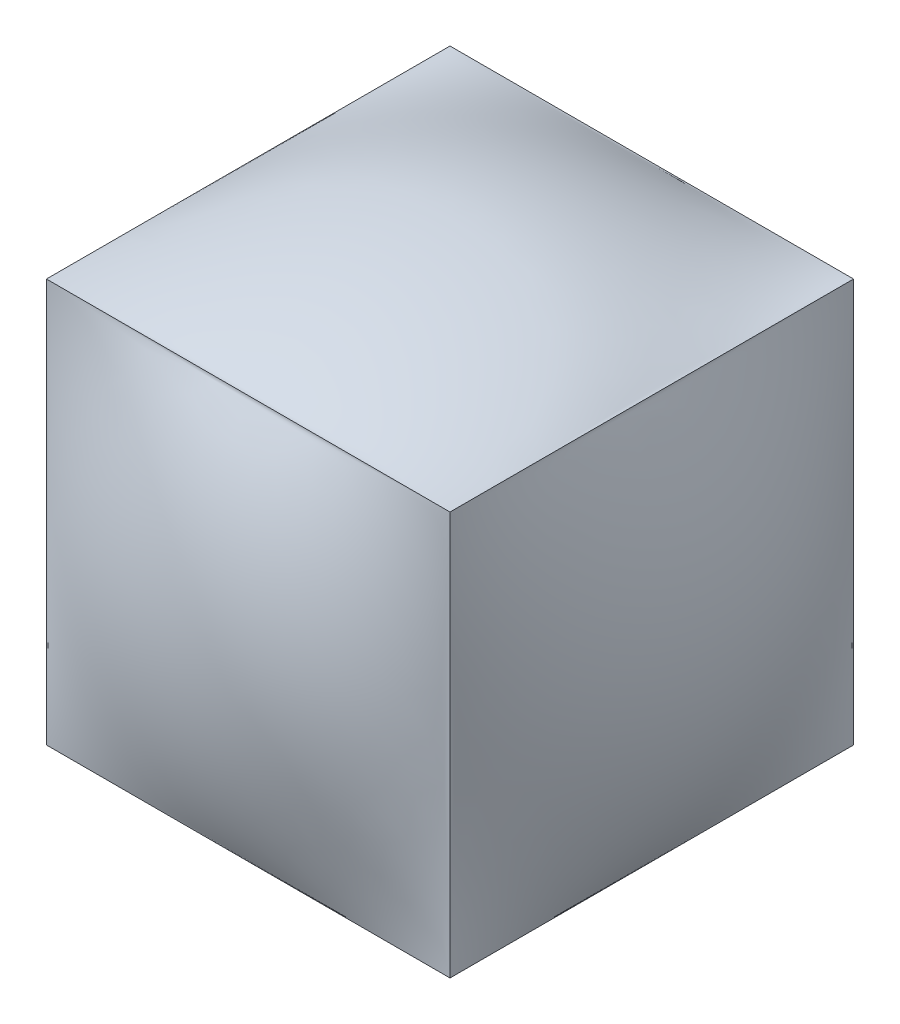
ISO-10303-21;
HEADER;
FILE_DESCRIPTION(('STEP AP214'),'2;1');
FILE_NAME('part.step','',(''),(''),'','','');
FILE_SCHEMA(('AUTOMOTIVE_DESIGN { 1 0 10303 214 1 1 1 1 }'));
ENDSEC;
DATA;
#1=APPLICATION_CONTEXT('core data for automotive mechanical design processes');
#2=APPLICATION_PROTOCOL_DEFINITION('international standard','automotive_design',2000,#1);
#3=PRODUCT_CONTEXT('',#1,'mechanical');
#4=PRODUCT('Part','Part','',(#3));
#5=PRODUCT_RELATED_PRODUCT_CATEGORY('part','',(#4));
#6=PRODUCT_DEFINITION_FORMATION('','',#4);
#7=PRODUCT_DEFINITION_CONTEXT('part definition',#1,'design');
#8=PRODUCT_DEFINITION('design','',#6,#7);
#9=PRODUCT_DEFINITION_SHAPE('','',#8);
#10=(LENGTH_UNIT() NAMED_UNIT(*) SI_UNIT(.MILLI.,.METRE.));
#11=(NAMED_UNIT(*) PLANE_ANGLE_UNIT() SI_UNIT($,.RADIAN.));
#12=(NAMED_UNIT(*) SI_UNIT($,.STERADIAN.) SOLID_ANGLE_UNIT());
#13=UNCERTAINTY_MEASURE_WITH_UNIT(LENGTH_MEASURE(1.E-05),#10,'distance_accuracy_value','');
#14=(GEOMETRIC_REPRESENTATION_CONTEXT(3) GLOBAL_UNCERTAINTY_ASSIGNED_CONTEXT((#13)) GLOBAL_UNIT_ASSIGNED_CONTEXT((#10,
#11,#12)) REPRESENTATION_CONTEXT('',''));
#15=CARTESIAN_POINT('',(0.,0.,0.));
#16=DIRECTION('',(0.,0.,1.));
#17=DIRECTION('',(1.,0.,0.));
#18=AXIS2_PLACEMENT_3D('',#15,#16,#17);
#19=CARTESIAN_POINT('',(-12.7,-12.7000000000001,12.6999999999999));
#20=CARTESIAN_POINT('',(-12.7,-12.7000000000001,8.46666666666658));
#21=CARTESIAN_POINT('',(-12.7,-12.7,0.));
#22=CARTESIAN_POINT('',(-12.7,-12.6999999999999,-8.46666666666676));
#23=CARTESIAN_POINT('',(-12.7,-12.6999999999999,-12.7000000000001));
#24=CARTESIAN_POINT('',(-11.6416666666667,-12.7000000000001,12.6999999999999));
#25=CARTESIAN_POINT('',(-11.6892399385699,-12.9708323422019,8.46666666666658));
#26=CARTESIAN_POINT('',(-11.8010748659707,-13.5437568192709,0.));
#27=CARTESIAN_POINT('',(-11.6892399385699,-12.9708323422018,-8.46666666666676));
#28=CARTESIAN_POINT('',(-11.6416666666667,-12.6999999999999,-12.7000000000001));
#29=CARTESIAN_POINT('',(-9.525,-12.7000000000001,12.6999999999999));
#30=CARTESIAN_POINT('',(-9.63309858409633,-13.5266884324954,8.50473083350684));
#31=CARTESIAN_POINT('',(-9.88267251947771,-14.9590467223422,-1.05178745472811E-13));
#32=CARTESIAN_POINT('',(-9.63309858409632,-13.5266884324953,-8.50473083350703));
#33=CARTESIAN_POINT('',(-9.525,-12.6999999999999,-12.7000000000001));
#34=CARTESIAN_POINT('',(-6.35000000000001,-12.7000000000001,12.6999999999999));
#35=CARTESIAN_POINT('',(-6.46865259362071,-14.27709550517,8.6189233340276));
#36=CARTESIAN_POINT('',(-6.73307640420296,-16.347931036693,-1.12577220955019E-13));
#37=CARTESIAN_POINT('',(-6.46865259362071,-14.2770955051698,-8.6189233340278));
#38=CARTESIAN_POINT('',(-6.35000000000001,-12.6999999999999,-12.7000000000001));
#39=CARTESIAN_POINT('',(-3.175,-12.7000000000001,12.6999999999999));
#40=CARTESIAN_POINT('',(-3.2490780150671,-14.8217020298357,8.73311583454839));
#41=CARTESIAN_POINT('',(-3.40557823699848,-17.0959688625182,-1.15500686733801E-13));
#42=CARTESIAN_POINT('',(-3.2490780150671,-14.8217020298356,-8.73311583454859));
#43=CARTESIAN_POINT('',(-3.175,-12.6999999999999,-12.7000000000001));
#44=CARTESIAN_POINT('',(-1.05833333333333,-12.7000000000001,12.6999999999999));
#45=CARTESIAN_POINT('',(-1.08330869872354,-14.9683052837959,8.77118000138864));
#46=CARTESIAN_POINT('',(-1.13325942950395,-17.2366105675916,-1.16459550176389E-13));
#47=CARTESIAN_POINT('',(-1.08330869872354,-14.9683052837957,-8.77118000138884));
#48=CARTESIAN_POINT('',(-1.05833333333333,-12.6999999999999,-12.7000000000001));
#49=CARTESIAN_POINT('',(1.05833333333333,-12.7000000000001,12.6999999999999));
#50=CARTESIAN_POINT('',(1.08330869872354,-14.9683052837959,8.77118000138864));
#51=CARTESIAN_POINT('',(1.13325942950395,-17.2366105675916,-1.16459550176389E-13));
#52=CARTESIAN_POINT('',(1.08330869872354,-14.9683052837957,-8.77118000138884));
#53=CARTESIAN_POINT('',(1.05833333333333,-12.6999999999999,-12.7000000000001));
#54=CARTESIAN_POINT('',(3.17500000000001,-12.7000000000001,12.6999999999999));
#55=CARTESIAN_POINT('',(3.2490780150671,-14.8217020298357,8.7331158345484));
#56=CARTESIAN_POINT('',(3.40557823699846,-17.0959688625182,-1.15965344807723E-13));
#57=CARTESIAN_POINT('',(3.2490780150671,-14.8217020298356,-8.73311583454861));
#58=CARTESIAN_POINT('',(3.17500000000001,-12.6999999999999,-12.7000000000001));
#59=CARTESIAN_POINT('',(6.34999999999999,-12.7000000000001,12.6999999999999));
#60=CARTESIAN_POINT('',(6.46865259362071,-14.27709550517,8.61892333402759));
#61=CARTESIAN_POINT('',(6.73307640420301,-16.3479310366931,-1.14435853250708E-13));
#62=CARTESIAN_POINT('',(6.46865259362071,-14.2770955051699,-8.61892333402779));
#63=CARTESIAN_POINT('',(6.34999999999999,-12.6999999999999,-12.7000000000001));
#64=CARTESIAN_POINT('',(9.52500000000001,-12.7000000000001,12.6999999999999));
#65=CARTESIAN_POINT('',(9.63309858409632,-13.5266884324953,8.50473083350685));
#66=CARTESIAN_POINT('',(9.8826725194777,-14.9590467223422,-1.09174804908543E-13));
#67=CARTESIAN_POINT('',(9.63309858409633,-13.5266884324952,-8.50473083350704));
#68=CARTESIAN_POINT('',(9.52500000000001,-12.6999999999999,-12.7000000000001));
#69=CARTESIAN_POINT('',(11.6416666666667,-12.7000000000001,12.6999999999999));
#70=CARTESIAN_POINT('',(11.6892399385699,-12.9708323422019,8.46666666666657));
#71=CARTESIAN_POINT('',(11.8010748659707,-13.5437568192709,-1.00523226508998E-13));
#72=CARTESIAN_POINT('',(11.6892399385699,-12.9708323422018,-8.46666666666676));
#73=CARTESIAN_POINT('',(11.6416666666667,-12.6999999999999,-12.7000000000001));
#74=CARTESIAN_POINT('',(12.7,-12.7000000000001,12.6999999999999));
#75=CARTESIAN_POINT('',(12.7,-12.7000000000001,8.46666666666657));
#76=CARTESIAN_POINT('',(12.7,-12.7,0.));
#77=CARTESIAN_POINT('',(12.7,-12.6999999999999,-8.46666666666676));
#78=CARTESIAN_POINT('',(12.7,-12.6999999999999,-12.7000000000001));
#79=B_SPLINE_SURFACE_WITH_KNOTS('',3,3,((#19,#20,#21,#22,#23),(#24,#25,#26,#27,#28),(#29,#30,
#31,#32,#33),(#34,#35,#36,#37,#38),(#39,#40,#41,#42,#43),(#44,#45,#46,#47,#48),(#49,#50,#51,#52,
#53),(#54,#55,#56,#57,#58),(#59,#60,#61,#62,#63),(#64,#65,#66,#67,#68),(#69,#70,#71,#72,#73),
(#74,#75,#76,#77,#78)),.UNSPECIFIED.,.F.,.F.,.F.,(4,1,1,1,2,1,1,1,4),(4,1,4),(0.,0.125,0.25,
0.375,0.5,0.625,0.75,0.875,1.),(0.,0.5,1.),.UNSPECIFIED.);
#80=DIRECTION('',(-1.,0.,0.));
#81=VECTOR('',#80,1.);
#82=CARTESIAN_POINT('',(0.,-12.7,12.7));
#83=LINE('',#82,#81);
#84=CARTESIAN_POINT('',(12.7,-12.7000000000001,12.7));
#85=VERTEX_POINT('',#84);
#86=CARTESIAN_POINT('',(-12.7,-12.7000000000001,12.6999999999999));
#87=VERTEX_POINT('',#86);
#88=EDGE_CURVE('E101',#85,#87,#83,.T.);
#89=DIRECTION('',(0.,0.,-1.));
#90=VECTOR('',#89,1.);
#91=CARTESIAN_POINT('',(-12.7,-12.7,0.));
#92=LINE('',#91,#90);
#93=CARTESIAN_POINT('',(-12.7,-12.7,-12.7000000000001));
#94=VERTEX_POINT('',#93);
#95=EDGE_CURVE('E65',#87,#94,#92,.T.);
#96=DIRECTION('',(1.,0.,0.));
#97=VECTOR('',#96,1.);
#98=CARTESIAN_POINT('',(0.,-12.6999999999999,-12.7000000000001));
#99=LINE('',#98,#97);
#100=CARTESIAN_POINT('',(12.7,-12.7,-12.7));
#101=VERTEX_POINT('',#100);
#102=EDGE_CURVE('E136',#94,#101,#99,.T.);
#103=DIRECTION('',(0.,0.,1.));
#104=VECTOR('',#103,1.);
#105=CARTESIAN_POINT('',(12.7,-12.7,1.33025516058267E-13));
#106=LINE('',#105,#104);
#107=EDGE_CURVE('E118',#101,#85,#106,.T.);
#108=ORIENTED_EDGE('',*,*,#88,.T.);
#109=ORIENTED_EDGE('',*,*,#95,.T.);
#110=ORIENTED_EDGE('',*,*,#102,.T.);
#111=ORIENTED_EDGE('',*,*,#107,.T.);
#112=EDGE_LOOP('',(#108,#109,#110,#111));
#113=FACE_BOUND('',#112,.T.);
#114=ADVANCED_FACE('F60',(#113),#79,.F.);
#115=CARTESIAN_POINT('',(-12.7,12.7,-12.7));
#116=CARTESIAN_POINT('',(-12.7,8.46666666666662,-12.7));
#117=CARTESIAN_POINT('',(-12.7,0.,-12.7));
#118=CARTESIAN_POINT('',(-12.6999999999999,-8.46666666666671,-12.7));
#119=CARTESIAN_POINT('',(-12.6999999999999,-12.7,-12.7));
#120=CARTESIAN_POINT('',(-12.7,12.7,-11.6416666666667));
#121=CARTESIAN_POINT('',(-12.9708323422018,8.46666666666662,-11.6892399385699));
#122=CARTESIAN_POINT('',(-13.5437568192708,0.,-11.8010748659707));
#123=CARTESIAN_POINT('',(-12.9708323422018,-8.46666666666671,-11.6892399385699));
#124=CARTESIAN_POINT('',(-12.6999999999999,-12.7,-11.6416666666667));
#125=CARTESIAN_POINT('',(-12.7,12.7,-9.52500000000004));
#126=CARTESIAN_POINT('',(-13.5266884324953,8.50473083350688,-9.63309858409637));
#127=CARTESIAN_POINT('',(-14.9590467223421,0.,-9.88267251947776));
#128=CARTESIAN_POINT('',(-13.5266884324952,-8.50473083350698,-9.63309858409637));
#129=CARTESIAN_POINT('',(-12.6999999999999,-12.7000000000001,-9.52500000000004));
#130=CARTESIAN_POINT('',(-12.7,12.6999999999999,-6.35000000000005));
#131=CARTESIAN_POINT('',(-14.2770955051699,8.61892333402765,-6.46865259362076));
#132=CARTESIAN_POINT('',(-16.347931036693,0.,-6.73307640420302));
#133=CARTESIAN_POINT('',(-14.2770955051698,-8.61892333402775,-6.46865259362076));
#134=CARTESIAN_POINT('',(-12.6999999999999,-12.7,-6.35000000000005));
#135=CARTESIAN_POINT('',(-12.7,12.7,-3.17500000000004));
#136=CARTESIAN_POINT('',(-14.8217020298356,8.73311583454844,-3.24907801506715));
#137=CARTESIAN_POINT('',(-17.0959688625182,0.,-3.40557823699854));
#138=CARTESIAN_POINT('',(-14.8217020298356,-8.73311583454854,-3.24907801506715));
#139=CARTESIAN_POINT('',(-12.6999999999999,-12.7,-3.17500000000004));
#140=CARTESIAN_POINT('',(-12.7,12.7,-1.05833333333338));
#141=CARTESIAN_POINT('',(-14.9683052837958,8.77118000138869,-1.08330869872359));
#142=CARTESIAN_POINT('',(-17.2366105675916,0.,-1.13325942950401));
#143=CARTESIAN_POINT('',(-14.9683052837958,-8.77118000138879,-1.08330869872359));
#144=CARTESIAN_POINT('',(-12.7,-12.7,-1.05833333333338));
#145=CARTESIAN_POINT('',(-12.7000000000001,12.7,1.05833333333329));
#146=CARTESIAN_POINT('',(-14.9683052837958,8.77118000138869,1.08330869872349));
#147=CARTESIAN_POINT('',(-17.2366105675916,0.,1.13325942950389));
#148=CARTESIAN_POINT('',(-14.9683052837958,-8.77118000138879,1.08330869872349));
#149=CARTESIAN_POINT('',(-12.7,-12.7,1.05833333333329));
#150=CARTESIAN_POINT('',(-12.7000000000001,12.7,3.17499999999997));
#151=CARTESIAN_POINT('',(-14.8217020298357,8.73311583454845,3.24907801506705));
#152=CARTESIAN_POINT('',(-17.0959688625182,0.,3.4055782369984));
#153=CARTESIAN_POINT('',(-14.8217020298356,-8.73311583454855,3.24907801506705));
#154=CARTESIAN_POINT('',(-12.7,-12.7000000000001,3.17499999999997));
#155=CARTESIAN_POINT('',(-12.7000000000001,12.6999999999999,6.34999999999994));
#156=CARTESIAN_POINT('',(-14.27709550517,8.61892333402764,6.46865259362066));
#157=CARTESIAN_POINT('',(-16.3479310366931,0.,6.73307640420295));
#158=CARTESIAN_POINT('',(-14.2770955051699,-8.61892333402774,6.46865259362066));
#159=CARTESIAN_POINT('',(-12.7,-12.7,6.34999999999994));
#160=CARTESIAN_POINT('',(-12.7000000000001,12.7,9.52499999999997));
#161=CARTESIAN_POINT('',(-13.5266884324953,8.50473083350689,9.63309858409627));
#162=CARTESIAN_POINT('',(-14.9590467223422,0.,9.88267251947764));
#163=CARTESIAN_POINT('',(-13.5266884324953,-8.50473083350699,9.63309858409628));
#164=CARTESIAN_POINT('',(-12.7,-12.7000000000001,9.52499999999997));
#165=CARTESIAN_POINT('',(-12.7000000000001,12.7,11.6416666666666));
#166=CARTESIAN_POINT('',(-12.9708323422019,8.46666666666662,11.6892399385698));
#167=CARTESIAN_POINT('',(-13.5437568192709,0.,11.8010748659707));
#168=CARTESIAN_POINT('',(-12.9708323422019,-8.46666666666671,11.6892399385698));
#169=CARTESIAN_POINT('',(-12.7,-12.7,11.6416666666666));
#170=CARTESIAN_POINT('',(-12.7000000000001,12.7,12.7));
#171=CARTESIAN_POINT('',(-12.7000000000001,8.46666666666662,12.7));
#172=CARTESIAN_POINT('',(-12.7,0.,12.6999999999999));
#173=CARTESIAN_POINT('',(-12.7,-8.46666666666671,12.7));
#174=CARTESIAN_POINT('',(-12.7,-12.7,12.7));
#175=B_SPLINE_SURFACE_WITH_KNOTS('',3,3,((#115,#116,#117,#118,#119),(#120,#121,#122,#123,#124),
(#125,#126,#127,#128,#129),(#130,#131,#132,#133,#134),(#135,#136,#137,#138,#139),(#140,#141,
#142,#143,#144),(#145,#146,#147,#148,#149),(#150,#151,#152,#153,#154),(#155,#156,#157,#158,
#159),(#160,#161,#162,#163,#164),(#165,#166,#167,#168,#169),(#170,#171,#172,#173,#174)),
.UNSPECIFIED.,.F.,.F.,.F.,(4,1,1,1,2,1,1,1,4),(4,1,4),(0.,0.125,0.25,0.375,0.5,0.625,0.75,0.875,
1.),(0.,0.5,1.),.UNSPECIFIED.);
#176=DIRECTION('',(0.,0.,-1.));
#177=VECTOR('',#176,1.);
#178=CARTESIAN_POINT('',(-12.7,12.7,0.));
#179=LINE('',#178,#177);
#180=CARTESIAN_POINT('',(-12.7,12.7,12.7));
#181=VERTEX_POINT('',#180);
#182=CARTESIAN_POINT('',(-12.7,12.7,-12.7));
#183=VERTEX_POINT('',#182);
#184=EDGE_CURVE('E81',#181,#183,#179,.T.);
#185=DIRECTION('',(0.,-1.,0.));
#186=VECTOR('',#185,1.);
#187=CARTESIAN_POINT('',(-12.7,1.3432655866525E-13,-12.7));
#188=LINE('',#187,#186);
#189=EDGE_CURVE('E109',#183,#94,#188,.T.);
#190=DIRECTION('',(0.,1.,0.));
#191=VECTOR('',#190,1.);
#192=CARTESIAN_POINT('',(-12.7,0.,12.7));
#193=LINE('',#192,#191);
#194=EDGE_CURVE('E107',#87,#181,#193,.T.);
#195=ORIENTED_EDGE('',*,*,#184,.T.);
#196=ORIENTED_EDGE('',*,*,#189,.T.);
#197=ORIENTED_EDGE('',*,*,#95,.F.);
#198=ORIENTED_EDGE('',*,*,#194,.T.);
#199=EDGE_LOOP('',(#195,#196,#197,#198));
#200=FACE_BOUND('',#199,.T.);
#201=ADVANCED_FACE('F106',(#200),#175,.F.);
#202=CARTESIAN_POINT('',(-12.7,12.7,12.7));
#203=CARTESIAN_POINT('',(-12.7,8.46666666666662,12.7));
#204=CARTESIAN_POINT('',(-12.7,0.,12.7));
#205=CARTESIAN_POINT('',(-12.7,-8.46666666666671,12.7));
#206=CARTESIAN_POINT('',(-12.7,-12.7,12.7));
#207=CARTESIAN_POINT('',(-11.6416666666667,12.7,12.7));
#208=CARTESIAN_POINT('',(-11.6892399385699,8.46666666666662,12.9708323422019));
#209=CARTESIAN_POINT('',(-11.8010748659707,0.,13.5437568192709));
#210=CARTESIAN_POINT('',(-11.6892399385699,-8.46666666666671,12.9708323422018));
#211=CARTESIAN_POINT('',(-11.6416666666667,-12.7,12.7));
#212=CARTESIAN_POINT('',(-9.525,12.7,12.7000000000001));
#213=CARTESIAN_POINT('',(-9.63309858409633,8.50473083350688,13.5266884324953));
#214=CARTESIAN_POINT('',(-9.88267251947771,0.,14.9590467223422));
#215=CARTESIAN_POINT('',(-9.63309858409632,-8.50473083350698,13.5266884324953));
#216=CARTESIAN_POINT('',(-9.525,-12.7000000000001,12.7));
#217=CARTESIAN_POINT('',(-6.35000000000001,12.6999999999999,12.7));
#218=CARTESIAN_POINT('',(-6.46865259362071,8.61892333402765,14.2770955051699));
#219=CARTESIAN_POINT('',(-6.73307640420296,0.,16.347931036693));
#220=CARTESIAN_POINT('',(-6.46865259362071,-8.61892333402775,14.2770955051699));
#221=CARTESIAN_POINT('',(-6.35000000000001,-12.7,12.7));
#222=CARTESIAN_POINT('',(-3.175,12.7,12.7));
#223=CARTESIAN_POINT('',(-3.2490780150671,8.73311583454844,14.8217020298357));
#224=CARTESIAN_POINT('',(-3.40557823699848,0.,17.0959688625182));
#225=CARTESIAN_POINT('',(-3.2490780150671,-8.73311583454854,14.8217020298356));
#226=CARTESIAN_POINT('',(-3.175,-12.7,12.7));
#227=CARTESIAN_POINT('',(-1.05833333333333,12.7,12.7));
#228=CARTESIAN_POINT('',(-1.08330869872354,8.77118000138869,14.9683052837958));
#229=CARTESIAN_POINT('',(-1.13325942950395,0.,17.2366105675916));
#230=CARTESIAN_POINT('',(-1.08330869872354,-8.77118000138879,14.9683052837958));
#231=CARTESIAN_POINT('',(-1.05833333333333,-12.7,12.7));
#232=CARTESIAN_POINT('',(1.05833333333333,12.7,12.7));
#233=CARTESIAN_POINT('',(1.08330869872354,8.77118000138869,14.9683052837958));
#234=CARTESIAN_POINT('',(1.13325942950395,0.,17.2366105675916));
#235=CARTESIAN_POINT('',(1.08330869872354,-8.77118000138879,14.9683052837958));
#236=CARTESIAN_POINT('',(1.05833333333333,-12.7,12.7));
#237=CARTESIAN_POINT('',(3.17500000000001,12.7,12.7000000000001));
#238=CARTESIAN_POINT('',(3.2490780150671,8.73311583454845,14.8217020298356));
#239=CARTESIAN_POINT('',(3.40557823699846,0.,17.0959688625182));
#240=CARTESIAN_POINT('',(3.2490780150671,-8.73311583454855,14.8217020298356));
#241=CARTESIAN_POINT('',(3.17500000000001,-12.7000000000001,12.7));
#242=CARTESIAN_POINT('',(6.34999999999999,12.6999999999999,12.7000000000001));
#243=CARTESIAN_POINT('',(6.46865259362071,8.61892333402764,14.2770955051699));
#244=CARTESIAN_POINT('',(6.73307640420301,0.,16.3479310366931));
#245=CARTESIAN_POINT('',(6.46865259362071,-8.61892333402774,14.2770955051699));
#246=CARTESIAN_POINT('',(6.34999999999999,-12.7,12.7));
#247=CARTESIAN_POINT('',(9.52500000000001,12.7,12.7));
#248=CARTESIAN_POINT('',(9.63309858409632,8.50473083350689,13.5266884324953));
#249=CARTESIAN_POINT('',(9.8826725194777,0.,14.9590467223422));
#250=CARTESIAN_POINT('',(9.63309858409633,-8.50473083350699,13.5266884324953));
#251=CARTESIAN_POINT('',(9.52500000000001,-12.7000000000001,12.7));
#252=CARTESIAN_POINT('',(11.6416666666667,12.7,12.7));
#253=CARTESIAN_POINT('',(11.6892399385699,8.46666666666662,12.9708323422019));
#254=CARTESIAN_POINT('',(11.8010748659707,0.,13.5437568192709));
#255=CARTESIAN_POINT('',(11.6892399385699,-8.46666666666671,12.9708323422018));
#256=CARTESIAN_POINT('',(11.6416666666667,-12.7,12.7));
#257=CARTESIAN_POINT('',(12.7,12.7,12.7));
#258=CARTESIAN_POINT('',(12.7,8.46666666666662,12.7));
#259=CARTESIAN_POINT('',(12.7,0.,12.7));
#260=CARTESIAN_POINT('',(12.7,-8.46666666666671,12.7));
#261=CARTESIAN_POINT('',(12.7,-12.7,12.7));
#262=B_SPLINE_SURFACE_WITH_KNOTS('',3,3,((#202,#203,#204,#205,#206),(#207,#208,#209,#210,#211),
(#212,#213,#214,#215,#216),(#217,#218,#219,#220,#221),(#222,#223,#224,#225,#226),(#227,#228,
#229,#230,#231),(#232,#233,#234,#235,#236),(#237,#238,#239,#240,#241),(#242,#243,#244,#245,
#246),(#247,#248,#249,#250,#251),(#252,#253,#254,#255,#256),(#257,#258,#259,#260,#261)),
.UNSPECIFIED.,.F.,.F.,.F.,(4,1,1,1,2,1,1,1,4),(4,1,4),(0.,0.125,0.25,0.375,0.5,0.625,0.75,0.875,
1.),(0.,0.5,1.),.UNSPECIFIED.);
#263=DIRECTION('',(-1.,0.,0.));
#264=VECTOR('',#263,1.);
#265=CARTESIAN_POINT('',(0.,12.7,12.7));
#266=LINE('',#265,#264);
#267=CARTESIAN_POINT('',(12.7,12.7,12.7000000000001));
#268=VERTEX_POINT('',#267);
#269=EDGE_CURVE('E115',#268,#181,#266,.T.);
#270=DIRECTION('',(0.,1.,0.));
#271=VECTOR('',#270,1.);
#272=CARTESIAN_POINT('',(12.6999999999999,0.,12.7000000000001));
#273=LINE('',#272,#271);
#274=EDGE_CURVE('E120',#85,#268,#273,.T.);
#275=ORIENTED_EDGE('',*,*,#269,.T.);
#276=ORIENTED_EDGE('',*,*,#194,.F.);
#277=ORIENTED_EDGE('',*,*,#88,.F.);
#278=ORIENTED_EDGE('',*,*,#274,.T.);
#279=EDGE_LOOP('',(#275,#276,#277,#278));
#280=FACE_BOUND('',#279,.T.);
#281=ADVANCED_FACE('F114',(#280),#262,.F.);
#282=CARTESIAN_POINT('',(12.6999999999999,12.7,12.7000000000001));
#283=CARTESIAN_POINT('',(12.6999999999999,8.46666666666662,12.7000000000001));
#284=CARTESIAN_POINT('',(12.6999999999999,0.,12.7000000000001));
#285=CARTESIAN_POINT('',(12.6999999999998,-8.46666666666671,12.7000000000001));
#286=CARTESIAN_POINT('',(12.6999999999998,-12.7,12.7000000000001));
#287=CARTESIAN_POINT('',(12.6999999999999,12.7,11.6416666666668));
#288=CARTESIAN_POINT('',(12.9708323422017,8.46666666666662,11.68923993857));
#289=CARTESIAN_POINT('',(13.5437568192708,0.,11.8010748659708));
#290=CARTESIAN_POINT('',(12.9708323422017,-8.46666666666671,11.68923993857));
#291=CARTESIAN_POINT('',(12.6999999999998,-12.7,11.6416666666668));
#292=CARTESIAN_POINT('',(12.7,12.7,9.52500000000013));
#293=CARTESIAN_POINT('',(13.5266884324952,8.50473083350688,9.63309858409647));
#294=CARTESIAN_POINT('',(14.9590467223421,0.,9.88267251947787));
#295=CARTESIAN_POINT('',(13.5266884324952,-8.50473083350698,9.63309858409647));
#296=CARTESIAN_POINT('',(12.6999999999999,-12.7000000000001,9.52500000000013));
#297=CARTESIAN_POINT('',(12.7,12.6999999999999,6.35000000000014));
#298=CARTESIAN_POINT('',(14.2770955051699,8.61892333402765,6.46865259362086));
#299=CARTESIAN_POINT('',(16.347931036693,0.,6.73307640420313));
#300=CARTESIAN_POINT('',(14.2770955051698,-8.61892333402775,6.46865259362086));
#301=CARTESIAN_POINT('',(12.6999999999999,-12.7,6.35000000000014));
#302=CARTESIAN_POINT('',(12.7,12.7,3.17500000000013));
#303=CARTESIAN_POINT('',(14.8217020298356,8.73311583454844,3.24907801506725));
#304=CARTESIAN_POINT('',(17.0959688625182,0.,3.40557823699866));
#305=CARTESIAN_POINT('',(14.8217020298356,-8.73311583454854,3.24907801506725));
#306=CARTESIAN_POINT('',(12.6999999999999,-12.7,3.17500000000013));
#307=CARTESIAN_POINT('',(12.7,12.7,1.05833333333347));
#308=CARTESIAN_POINT('',(14.9683052837958,8.77118000138869,1.0833086987237));
#309=CARTESIAN_POINT('',(17.2366105675916,0.,1.13325942950413));
#310=CARTESIAN_POINT('',(14.9683052837958,-8.77118000138879,1.0833086987237));
#311=CARTESIAN_POINT('',(12.6999999999999,-12.7,1.05833333333347));
#312=CARTESIAN_POINT('',(12.7000000000001,12.7,-1.0583333333332));
#313=CARTESIAN_POINT('',(14.9683052837958,8.77118000138869,-1.08330869872338));
#314=CARTESIAN_POINT('',(17.2366105675916,0.,-1.13325942950377));
#315=CARTESIAN_POINT('',(14.9683052837958,-8.77118000138879,-1.08330869872338));
#316=CARTESIAN_POINT('',(12.7,-12.7,-1.0583333333332));
#317=CARTESIAN_POINT('',(12.7000000000001,12.7,-3.17499999999988));
#318=CARTESIAN_POINT('',(14.8217020298357,8.73311583454845,-3.24907801506694));
#319=CARTESIAN_POINT('',(17.0959688625182,0.,-3.40557823699828));
#320=CARTESIAN_POINT('',(14.8217020298356,-8.73311583454855,-3.24907801506694));
#321=CARTESIAN_POINT('',(12.7,-12.7000000000001,-3.17499999999988));
#322=CARTESIAN_POINT('',(12.7000000000001,12.6999999999999,-6.34999999999986));
#323=CARTESIAN_POINT('',(14.27709550517,8.61892333402764,-6.46865259362056));
#324=CARTESIAN_POINT('',(16.3479310366931,0.,-6.73307640420284));
#325=CARTESIAN_POINT('',(14.27709550517,-8.61892333402774,-6.46865259362056));
#326=CARTESIAN_POINT('',(12.7,-12.7,-6.34999999999986));
#327=CARTESIAN_POINT('',(12.7000000000001,12.7,-9.52499999999988));
#328=CARTESIAN_POINT('',(13.5266884324954,8.50473083350689,-9.63309858409618));
#329=CARTESIAN_POINT('',(14.9590467223423,0.,-9.88267251947754));
#330=CARTESIAN_POINT('',(13.5266884324954,-8.50473083350699,-9.63309858409619));
#331=CARTESIAN_POINT('',(12.7000000000001,-12.7000000000001,-9.52499999999988));
#332=CARTESIAN_POINT('',(12.7000000000002,12.7,-11.6416666666665));
#333=CARTESIAN_POINT('',(12.970832342202,8.46666666666662,-11.6892399385698));
#334=CARTESIAN_POINT('',(13.543756819271,0.,-11.8010748659706));
#335=CARTESIAN_POINT('',(12.9708323422019,-8.46666666666671,-11.6892399385698));
#336=CARTESIAN_POINT('',(12.7000000000001,-12.7,-11.6416666666665));
#337=CARTESIAN_POINT('',(12.7000000000002,12.7,-12.6999999999999));
#338=CARTESIAN_POINT('',(12.7000000000002,8.46666666666662,-12.6999999999999));
#339=CARTESIAN_POINT('',(12.7000000000001,0.,-12.6999999999999));
#340=CARTESIAN_POINT('',(12.7000000000001,-8.46666666666671,-12.6999999999999));
#341=CARTESIAN_POINT('',(12.7000000000001,-12.7,-12.6999999999999));
#342=B_SPLINE_SURFACE_WITH_KNOTS('',3,3,((#282,#283,#284,#285,#286),(#287,#288,#289,#290,#291),
(#292,#293,#294,#295,#296),(#297,#298,#299,#300,#301),(#302,#303,#304,#305,#306),(#307,#308,
#309,#310,#311),(#312,#313,#314,#315,#316),(#317,#318,#319,#320,#321),(#322,#323,#324,#325,
#326),(#327,#328,#329,#330,#331),(#332,#333,#334,#335,#336),(#337,#338,#339,#340,#341)),
.UNSPECIFIED.,.F.,.F.,.F.,(4,1,1,1,2,1,1,1,4),(4,1,4),(0.,0.125,0.25,0.375,0.5,0.625,0.75,0.875,
1.),(0.,0.5,1.),.UNSPECIFIED.);
#343=DIRECTION('',(0.,0.,1.));
#344=VECTOR('',#343,1.);
#345=CARTESIAN_POINT('',(12.7,12.7,0.));
#346=LINE('',#345,#344);
#347=CARTESIAN_POINT('',(12.7000000000001,12.7,-12.6999999999999));
#348=VERTEX_POINT('',#347);
#349=EDGE_CURVE('E72',#348,#268,#346,.T.);
#350=DIRECTION('',(0.,1.,0.));
#351=VECTOR('',#350,1.);
#352=CARTESIAN_POINT('',(12.7,1.37362324748209E-13,-12.7));
#353=LINE('',#352,#351);
#354=EDGE_CURVE('E132',#101,#348,#353,.T.);
#355=ORIENTED_EDGE('',*,*,#349,.T.);
#356=ORIENTED_EDGE('',*,*,#274,.F.);
#357=ORIENTED_EDGE('',*,*,#107,.F.);
#358=ORIENTED_EDGE('',*,*,#354,.T.);
#359=EDGE_LOOP('',(#355,#356,#357,#358));
#360=FACE_BOUND('',#359,.T.);
#361=ADVANCED_FACE('F151',(#360),#342,.F.);
#362=CARTESIAN_POINT('',(-12.7,-12.6999999999999,-12.7000000000001));
#363=CARTESIAN_POINT('',(-12.7,-8.46666666666653,-12.7000000000001));
#364=CARTESIAN_POINT('',(-12.7,1.35255874813095E-13,-12.7));
#365=CARTESIAN_POINT('',(-12.7,8.4666666666668,-12.6999999999999));
#366=CARTESIAN_POINT('',(-12.7,12.7000000000001,-12.6999999999999));
#367=CARTESIAN_POINT('',(-11.6416666666667,-12.6999999999999,-12.7000000000001));
#368=CARTESIAN_POINT('',(-11.6892399385699,-8.46666666666653,-12.9708323422019));
#369=CARTESIAN_POINT('',(-11.8010748659707,1.44093763499015E-13,-13.5437568192709));
#370=CARTESIAN_POINT('',(-11.6892399385699,8.4666666666668,-12.9708323422018));
#371=CARTESIAN_POINT('',(-11.6416666666667,12.7000000000001,-12.6999999999999));
#372=CARTESIAN_POINT('',(-9.525,-12.6999999999999,-12.7000000000001));
#373=CARTESIAN_POINT('',(-9.63309858409633,-8.50473083350679,-13.5266884324954));
#374=CARTESIAN_POINT('',(-9.88267251947771,1.57408008201926E-13,-14.9590467223422));
#375=CARTESIAN_POINT('',(-9.63309858409632,8.50473083350708,-13.5266884324952));
#376=CARTESIAN_POINT('',(-9.525,12.7000000000001,-12.6999999999999));
#377=CARTESIAN_POINT('',(-6.35000000000001,-12.6999999999999,-12.7000000000001));
#378=CARTESIAN_POINT('',(-6.46865259362071,-8.61892333402755,-14.27709550517));
#379=CARTESIAN_POINT('',(-6.73307640420296,1.69655750158196E-13,-16.347931036693));
#380=CARTESIAN_POINT('',(-6.46865259362071,8.61892333402785,-14.2770955051698));
#381=CARTESIAN_POINT('',(-6.35000000000001,12.7000000000001,-12.6999999999999));
#382=CARTESIAN_POINT('',(-3.175,-12.6999999999999,-12.7000000000001));
#383=CARTESIAN_POINT('',(-3.2490780150671,-8.73311583454834,-14.8217020298357));
#384=CARTESIAN_POINT('',(-3.40557823699848,1.75190977559328E-13,-17.0959688625182));
#385=CARTESIAN_POINT('',(-3.2490780150671,8.73311583454864,-14.8217020298355));
#386=CARTESIAN_POINT('',(-3.175,12.7000000000001,-12.6999999999999));
#387=CARTESIAN_POINT('',(-1.05833333333333,-12.6999999999999,-12.7000000000001));
#388=CARTESIAN_POINT('',(-1.08330869872354,-8.77118000138859,-14.9683052837959));
#389=CARTESIAN_POINT('',(-1.13325942950395,1.76640889175057E-13,-17.2366105675916));
#390=CARTESIAN_POINT('',(-1.08330869872354,8.7711800013889,-14.9683052837957));
#391=CARTESIAN_POINT('',(-1.05833333333333,12.7000000000001,-12.6999999999999));
#392=CARTESIAN_POINT('',(1.05833333333333,-12.6999999999999,-12.7000000000001));
#393=CARTESIAN_POINT('',(1.08330869872354,-8.77118000138859,-14.9683052837959));
#394=CARTESIAN_POINT('',(1.13325942950395,1.76640889175057E-13,-17.2366105675916));
#395=CARTESIAN_POINT('',(1.08330869872354,8.7711800013889,-14.9683052837957));
#396=CARTESIAN_POINT('',(1.05833333333333,12.7000000000001,-12.6999999999999));
#397=CARTESIAN_POINT('',(3.17500000000001,-12.6999999999999,-12.7000000000001));
#398=CARTESIAN_POINT('',(3.2490780150671,-8.73311583454835,-14.8217020298357));
#399=CARTESIAN_POINT('',(3.40557823699846,1.7565563563325E-13,-17.0959688625182));
#400=CARTESIAN_POINT('',(3.2490780150671,8.73311583454866,-14.8217020298355));
#401=CARTESIAN_POINT('',(3.17500000000001,12.7000000000002,-12.6999999999999));
#402=CARTESIAN_POINT('',(6.34999999999999,-12.6999999999998,-12.7000000000001));
#403=CARTESIAN_POINT('',(6.46865259362071,-8.61892333402754,-14.27709550517));
#404=CARTESIAN_POINT('',(6.73307640420301,1.71514382453886E-13,-16.3479310366931));
#405=CARTESIAN_POINT('',(6.46865259362071,8.61892333402784,-14.2770955051698));
#406=CARTESIAN_POINT('',(6.34999999999999,12.7000000000001,-12.6999999999999));
#407=CARTESIAN_POINT('',(9.52500000000001,-12.6999999999999,-12.7000000000001));
#408=CARTESIAN_POINT('',(9.63309858409632,-8.5047308335068,-13.5266884324954));
#409=CARTESIAN_POINT('',(9.8826725194777,1.61404067637659E-13,-14.9590467223422));
#410=CARTESIAN_POINT('',(9.63309858409633,8.50473083350709,-13.5266884324952));
#411=CARTESIAN_POINT('',(9.52500000000001,12.7000000000002,-12.6999999999999));
#412=CARTESIAN_POINT('',(11.6416666666667,-12.6999999999999,-12.7000000000001));
#413=CARTESIAN_POINT('',(11.6892399385699,-8.46666666666652,-12.9708323422019));
#414=CARTESIAN_POINT('',(11.8010748659707,1.47811028090394E-13,-13.5437568192709));
#415=CARTESIAN_POINT('',(11.6892399385699,8.4666666666668,-12.9708323422018));
#416=CARTESIAN_POINT('',(11.6416666666667,12.7000000000001,-12.6999999999999));
#417=CARTESIAN_POINT('',(12.7,-12.6999999999999,-12.7000000000001));
#418=CARTESIAN_POINT('',(12.7,-8.46666666666653,-12.7000000000001));
#419=CARTESIAN_POINT('',(12.7,1.38973139404474E-13,-12.7));
#420=CARTESIAN_POINT('',(12.7,8.4666666666668,-12.6999999999999));
#421=CARTESIAN_POINT('',(12.7,12.7000000000001,-12.6999999999999));
#422=B_SPLINE_SURFACE_WITH_KNOTS('',3,3,((#362,#363,#364,#365,#366),(#367,#368,#369,#370,#371),
(#372,#373,#374,#375,#376),(#377,#378,#379,#380,#381),(#382,#383,#384,#385,#386),(#387,#388,
#389,#390,#391),(#392,#393,#394,#395,#396),(#397,#398,#399,#400,#401),(#402,#403,#404,#405,
#406),(#407,#408,#409,#410,#411),(#412,#413,#414,#415,#416),(#417,#418,#419,#420,#421)),
.UNSPECIFIED.,.F.,.F.,.F.,(4,1,1,1,2,1,1,1,4),(4,1,4),(0.,0.125,0.25,0.375,0.5,0.625,0.75,0.875,
1.),(0.,0.5,1.),.UNSPECIFIED.);
#423=DIRECTION('',(1.,0.,0.));
#424=VECTOR('',#423,1.);
#425=CARTESIAN_POINT('',(0.,12.7,-12.7));
#426=LINE('',#425,#424);
#427=EDGE_CURVE('E13',#183,#348,#426,.T.);
#428=ORIENTED_EDGE('',*,*,#102,.F.);
#429=ORIENTED_EDGE('',*,*,#189,.F.);
#430=ORIENTED_EDGE('',*,*,#427,.T.);
#431=ORIENTED_EDGE('',*,*,#354,.F.);
#432=EDGE_LOOP('',(#428,#429,#430,#431));
#433=FACE_BOUND('',#432,.T.);
#434=ADVANCED_FACE('F155',(#433),#422,.F.);
#435=CARTESIAN_POINT('',(-12.7,12.7,-12.7));
#436=CARTESIAN_POINT('',(-12.7,12.7,-8.46666666666667));
#437=CARTESIAN_POINT('',(-12.7,12.7,0.));
#438=CARTESIAN_POINT('',(-12.7,12.7,8.46666666666667));
#439=CARTESIAN_POINT('',(-12.7,12.7,12.7));
#440=CARTESIAN_POINT('',(-11.6416666666667,12.7,-12.7));
#441=CARTESIAN_POINT('',(-11.6892399385699,12.9708323422018,-8.46666666666667));
#442=CARTESIAN_POINT('',(-11.8010748659707,13.5437568192709,0.));
#443=CARTESIAN_POINT('',(-11.6892399385699,12.9708323422018,8.46666666666667));
#444=CARTESIAN_POINT('',(-11.6416666666667,12.7,12.7));
#445=CARTESIAN_POINT('',(-9.525,12.7,-12.7));
#446=CARTESIAN_POINT('',(-9.63309858409633,13.5266884324953,-8.50473083350693));
#447=CARTESIAN_POINT('',(-9.88267251947771,14.9590467223422,0.));
#448=CARTESIAN_POINT('',(-9.63309858409632,13.5266884324953,8.50473083350693));
#449=CARTESIAN_POINT('',(-9.525,12.7,12.7));
#450=CARTESIAN_POINT('',(-6.35000000000001,12.7,-12.7));
#451=CARTESIAN_POINT('',(-6.46865259362071,14.2770955051699,-8.6189233340277));
#452=CARTESIAN_POINT('',(-6.73307640420296,16.347931036693,0.));
#453=CARTESIAN_POINT('',(-6.46865259362071,14.2770955051699,8.6189233340277));
#454=CARTESIAN_POINT('',(-6.35000000000001,12.7,12.7));
#455=CARTESIAN_POINT('',(-3.175,12.7,-12.7));
#456=CARTESIAN_POINT('',(-3.2490780150671,14.8217020298356,-8.73311583454849));
#457=CARTESIAN_POINT('',(-3.40557823699848,17.0959688625182,0.));
#458=CARTESIAN_POINT('',(-3.2490780150671,14.8217020298356,8.73311583454849));
#459=CARTESIAN_POINT('',(-3.175,12.7,12.7));
#460=CARTESIAN_POINT('',(-1.05833333333333,12.7,-12.7));
#461=CARTESIAN_POINT('',(-1.08330869872354,14.9683052837958,-8.77118000138875));
#462=CARTESIAN_POINT('',(-1.13325942950395,17.2366105675916,0.));
#463=CARTESIAN_POINT('',(-1.08330869872354,14.9683052837958,8.77118000138874));
#464=CARTESIAN_POINT('',(-1.05833333333333,12.7,12.7));
#465=CARTESIAN_POINT('',(1.05833333333333,12.7,-12.7));
#466=CARTESIAN_POINT('',(1.08330869872354,14.9683052837958,-8.77118000138875));
#467=CARTESIAN_POINT('',(1.13325942950395,17.2366105675916,0.));
#468=CARTESIAN_POINT('',(1.08330869872354,14.9683052837958,8.77118000138874));
#469=CARTESIAN_POINT('',(1.05833333333333,12.7,12.7));
#470=CARTESIAN_POINT('',(3.17500000000001,12.7,-12.7));
#471=CARTESIAN_POINT('',(3.2490780150671,14.8217020298356,-8.73311583454851));
#472=CARTESIAN_POINT('',(3.40557823699846,17.0959688625182,0.));
#473=CARTESIAN_POINT('',(3.2490780150671,14.8217020298356,8.7331158345485));
#474=CARTESIAN_POINT('',(3.17500000000001,12.7,12.7));
#475=CARTESIAN_POINT('',(6.34999999999999,12.7,-12.7));
#476=CARTESIAN_POINT('',(6.46865259362071,14.2770955051699,-8.61892333402769));
#477=CARTESIAN_POINT('',(6.73307640420301,16.3479310366931,0.));
#478=CARTESIAN_POINT('',(6.46865259362071,14.2770955051699,8.61892333402769));
#479=CARTESIAN_POINT('',(6.34999999999999,12.7,12.7));
#480=CARTESIAN_POINT('',(9.52500000000001,12.7,-12.7));
#481=CARTESIAN_POINT('',(9.63309858409632,13.5266884324953,-8.50473083350694));
#482=CARTESIAN_POINT('',(9.8826725194777,14.9590467223422,0.));
#483=CARTESIAN_POINT('',(9.63309858409633,13.5266884324953,8.50473083350694));
#484=CARTESIAN_POINT('',(9.52500000000001,12.7,12.7));
#485=CARTESIAN_POINT('',(11.6416666666667,12.7,-12.7));
#486=CARTESIAN_POINT('',(11.6892399385699,12.9708323422018,-8.46666666666666));
#487=CARTESIAN_POINT('',(11.8010748659707,13.5437568192709,0.));
#488=CARTESIAN_POINT('',(11.6892399385699,12.9708323422018,8.46666666666667));
#489=CARTESIAN_POINT('',(11.6416666666667,12.7,12.7));
#490=CARTESIAN_POINT('',(12.7,12.7,-12.7));
#491=CARTESIAN_POINT('',(12.7,12.7,-8.46666666666666));
#492=CARTESIAN_POINT('',(12.7,12.7,0.));
#493=CARTESIAN_POINT('',(12.7,12.7,8.46666666666667));
#494=CARTESIAN_POINT('',(12.7,12.7,12.7));
#495=B_SPLINE_SURFACE_WITH_KNOTS('',3,3,((#435,#436,#437,#438,#439),(#440,#441,#442,#443,#444),
(#445,#446,#447,#448,#449),(#450,#451,#452,#453,#454),(#455,#456,#457,#458,#459),(#460,#461,
#462,#463,#464),(#465,#466,#467,#468,#469),(#470,#471,#472,#473,#474),(#475,#476,#477,#478,
#479),(#480,#481,#482,#483,#484),(#485,#486,#487,#488,#489),(#490,#491,#492,#493,#494)),
.UNSPECIFIED.,.F.,.F.,.F.,(4,1,1,1,2,1,1,1,4),(4,1,4),(0.,0.125,0.25,0.375,0.5,0.625,0.75,0.875,
1.),(0.,0.5,1.),.UNSPECIFIED.);
#496=ORIENTED_EDGE('',*,*,#427,.F.);
#497=ORIENTED_EDGE('',*,*,#184,.F.);
#498=ORIENTED_EDGE('',*,*,#269,.F.);
#499=ORIENTED_EDGE('',*,*,#349,.F.);
#500=EDGE_LOOP('',(#496,#497,#498,#499));
#501=FACE_BOUND('',#500,.T.);
#502=ADVANCED_FACE('F153',(#501),#495,.F.);
#503=CLOSED_SHELL('',(#114,#201,#281,#361,#434,#502));
#504=MANIFOLD_SOLID_BREP('B2',#503);
#505=ADVANCED_BREP_SHAPE_REPRESENTATION('',(#18,#504),#14);
#506=SHAPE_DEFINITION_REPRESENTATION(#9,#505);
ENDSEC;
END-ISO-10303-21;
